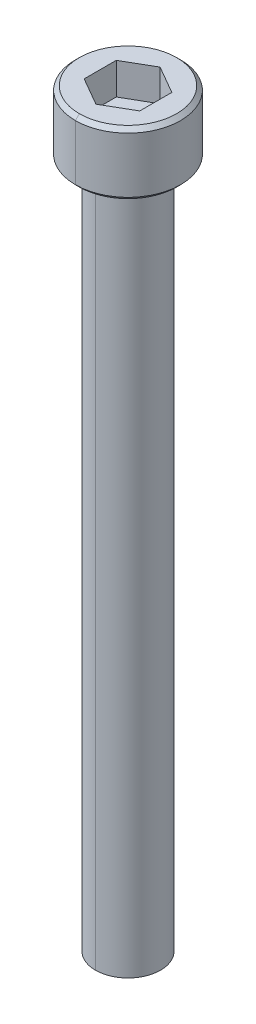
ISO-10303-21;
HEADER;
FILE_DESCRIPTION(('STEP AP214'),'2;1');
FILE_NAME('part.step','',(''),(''),'','','');
FILE_SCHEMA(('AUTOMOTIVE_DESIGN { 1 0 10303 214 1 1 1 1 }'));
ENDSEC;
DATA;
#1=APPLICATION_CONTEXT('core data for automotive mechanical design processes');
#2=APPLICATION_PROTOCOL_DEFINITION('international standard','automotive_design',2000,#1);
#3=PRODUCT_CONTEXT('',#1,'mechanical');
#4=PRODUCT('Part','Part','',(#3));
#5=PRODUCT_RELATED_PRODUCT_CATEGORY('part','',(#4));
#6=PRODUCT_DEFINITION_FORMATION('','',#4);
#7=PRODUCT_DEFINITION_CONTEXT('part definition',#1,'design');
#8=PRODUCT_DEFINITION('design','',#6,#7);
#9=PRODUCT_DEFINITION_SHAPE('','',#8);
#10=(LENGTH_UNIT() NAMED_UNIT(*) SI_UNIT(.MILLI.,.METRE.));
#11=(NAMED_UNIT(*) PLANE_ANGLE_UNIT() SI_UNIT($,.RADIAN.));
#12=(NAMED_UNIT(*) SI_UNIT($,.STERADIAN.) SOLID_ANGLE_UNIT());
#13=UNCERTAINTY_MEASURE_WITH_UNIT(LENGTH_MEASURE(1.E-05),#10,'distance_accuracy_value','');
#14=(GEOMETRIC_REPRESENTATION_CONTEXT(3) GLOBAL_UNCERTAINTY_ASSIGNED_CONTEXT((#13)) GLOBAL_UNIT_ASSIGNED_CONTEXT((#10,
#11,#12)) REPRESENTATION_CONTEXT('',''));
#15=CARTESIAN_POINT('',(0.,0.,0.));
#16=DIRECTION('',(0.,0.,1.));
#17=DIRECTION('',(1.,0.,0.));
#18=AXIS2_PLACEMENT_3D('',#15,#16,#17);
#19=CARTESIAN_POINT('',(0.,-43.91152,0.));
#20=DIRECTION('',(0.,1.,0.));
#21=DIRECTION('',(0.,0.,1.));
#22=AXIS2_PLACEMENT_3D('',#19,#20,#21);
#23=CONICAL_SURFACE('',#22,2.0828,0.960291895410485);
#24=DIRECTION('',(0.,0.573280843383966,-0.819358941251616));
#25=VECTOR('',#24,1.);
#26=CARTESIAN_POINT('',(0.,-43.91152,-2.0828));
#27=LINE('',#26,#25);
#28=CARTESIAN_POINT('',(0.,-44.45,-1.31318));
#29=VERTEX_POINT('',#28);
#30=CARTESIAN_POINT('',(0.,-43.91152,-2.0828));
#31=VERTEX_POINT('',#30);
#32=EDGE_CURVE('E205',#29,#31,#27,.T.);
#33=ORIENTED_EDGE('',*,*,#32,.F.);
#34=CARTESIAN_POINT('',(0.,-44.45,0.));
#35=DIRECTION('',(0.,-1.,0.));
#36=DIRECTION('',(0.,0.,1.));
#37=AXIS2_PLACEMENT_3D('',#34,#35,#36);
#38=CIRCLE('',#37,1.31318);
#39=CARTESIAN_POINT('',(0.,-44.45,1.31318));
#40=VERTEX_POINT('',#39);
#41=EDGE_CURVE('E151',#40,#29,#38,.T.);
#42=ORIENTED_EDGE('',*,*,#41,.F.);
#43=DIRECTION('',(0.,0.573280843383966,0.819358941251616));
#44=VECTOR('',#43,1.);
#45=CARTESIAN_POINT('',(0.,-43.91152,2.0828));
#46=LINE('',#45,#44);
#47=CARTESIAN_POINT('',(0.,-43.91152,2.0828));
#48=VERTEX_POINT('',#47);
#49=EDGE_CURVE('E232',#40,#48,#46,.T.);
#50=ORIENTED_EDGE('',*,*,#49,.T.);
#51=CARTESIAN_POINT('',(0.,-43.91152,0.));
#52=DIRECTION('',(0.,1.,0.));
#53=DIRECTION('',(0.,0.,1.));
#54=AXIS2_PLACEMENT_3D('',#51,#52,#53);
#55=CIRCLE('',#54,2.0828);
#56=EDGE_CURVE('E180',#31,#48,#55,.T.);
#57=ORIENTED_EDGE('',*,*,#56,.F.);
#58=EDGE_LOOP('',(#33,#42,#50,#57));
#59=FACE_BOUND('',#58,.T.);
#60=ADVANCED_FACE('F16',(#59),#23,.T.);
#61=CARTESIAN_POINT('',(0.,0.254,0.));
#62=DIRECTION('',(0.,1.,0.));
#63=DIRECTION('',(0.,0.,1.));
#64=AXIS2_PLACEMENT_3D('',#61,#62,#63);
#65=CONICAL_SURFACE('',#64,3.3655,0.785398163397457);
#66=DIRECTION('',(0.,0.707106781186541,-0.707106781186554));
#67=VECTOR('',#66,1.);
#68=CARTESIAN_POINT('',(0.,0.254,-3.3655));
#69=LINE('',#68,#67);
#70=CARTESIAN_POINT('',(0.,0.,-3.1115));
#71=VERTEX_POINT('',#70);
#72=CARTESIAN_POINT('',(0.,0.254,-3.3655));
#73=VERTEX_POINT('',#72);
#74=EDGE_CURVE('E236',#71,#73,#69,.T.);
#75=ORIENTED_EDGE('',*,*,#74,.F.);
#76=CARTESIAN_POINT('',(0.,0.,0.));
#77=DIRECTION('',(0.,-1.,0.));
#78=DIRECTION('',(0.,0.,1.));
#79=AXIS2_PLACEMENT_3D('',#76,#77,#78);
#80=CIRCLE('',#79,3.1115);
#81=CARTESIAN_POINT('',(0.,0.,3.1115));
#82=VERTEX_POINT('',#81);
#83=EDGE_CURVE('E188',#82,#71,#80,.T.);
#84=ORIENTED_EDGE('',*,*,#83,.F.);
#85=DIRECTION('',(0.,0.707106781186541,0.707106781186554));
#86=VECTOR('',#85,1.);
#87=CARTESIAN_POINT('',(0.,0.254,3.3655));
#88=LINE('',#87,#86);
#89=CARTESIAN_POINT('',(0.,0.254,3.3655));
#90=VERTEX_POINT('',#89);
#91=EDGE_CURVE('E176',#82,#90,#88,.T.);
#92=ORIENTED_EDGE('',*,*,#91,.T.);
#93=CARTESIAN_POINT('',(0.,0.254,0.));
#94=DIRECTION('',(0.,1.,0.));
#95=DIRECTION('',(0.,0.,1.));
#96=AXIS2_PLACEMENT_3D('',#93,#94,#95);
#97=CIRCLE('',#96,3.3655);
#98=EDGE_CURVE('E150',#73,#90,#97,.T.);
#99=ORIENTED_EDGE('',*,*,#98,.F.);
#100=EDGE_LOOP('',(#75,#84,#92,#99));
#101=FACE_BOUND('',#100,.T.);
#102=ADVANCED_FACE('F332',(#101),#65,.T.);
#103=CARTESIAN_POINT('',(0.,4.064,0.));
#104=DIRECTION('',(0.,-1.,0.));
#105=DIRECTION('',(0.,0.,-1.));
#106=AXIS2_PLACEMENT_3D('',#103,#104,#105);
#107=CONICAL_SURFACE('',#106,3.1115,0.785398163397452);
#108=DIRECTION('',(0.,-0.707106781186545,0.707106781186551));
#109=VECTOR('',#108,1.);
#110=CARTESIAN_POINT('',(0.,4.064,3.1115));
#111=LINE('',#110,#109);
#112=CARTESIAN_POINT('',(0.,4.064,3.1115));
#113=VERTEX_POINT('',#112);
#114=CARTESIAN_POINT('',(0.,3.81,3.3655));
#115=VERTEX_POINT('',#114);
#116=EDGE_CURVE('E141',#113,#115,#111,.T.);
#117=ORIENTED_EDGE('',*,*,#116,.F.);
#118=CARTESIAN_POINT('',(0.,4.064,0.));
#119=DIRECTION('',(0.,1.,0.));
#120=DIRECTION('',(0.,0.,1.));
#121=AXIS2_PLACEMENT_3D('',#118,#119,#120);
#122=CIRCLE('',#121,3.1115);
#123=CARTESIAN_POINT('',(0.,4.064,-3.1115));
#124=VERTEX_POINT('',#123);
#125=EDGE_CURVE('E272',#124,#113,#122,.T.);
#126=ORIENTED_EDGE('',*,*,#125,.F.);
#127=DIRECTION('',(0.,-0.707106781186545,-0.707106781186551));
#128=VECTOR('',#127,1.);
#129=CARTESIAN_POINT('',(0.,4.064,-3.1115));
#130=LINE('',#129,#128);
#131=CARTESIAN_POINT('',(0.,3.81,-3.3655));
#132=VERTEX_POINT('',#131);
#133=EDGE_CURVE('E144',#124,#132,#130,.T.);
#134=ORIENTED_EDGE('',*,*,#133,.T.);
#135=CARTESIAN_POINT('',(0.,3.81,0.));
#136=DIRECTION('',(0.,-1.,0.));
#137=DIRECTION('',(0.,0.,1.));
#138=AXIS2_PLACEMENT_3D('',#135,#136,#137);
#139=CIRCLE('',#138,3.3655);
#140=EDGE_CURVE('E137',#115,#132,#139,.T.);
#141=ORIENTED_EDGE('',*,*,#140,.F.);
#142=EDGE_LOOP('',(#117,#126,#134,#141));
#143=FACE_BOUND('',#142,.T.);
#144=ADVANCED_FACE('F139',(#143),#107,.T.);
#145=CARTESIAN_POINT('',(1.778,2.032,3.07958633585746));
#146=DIRECTION('',(0.,1.,0.));
#147=DIRECTION('',(1.,0.,0.));
#148=AXIS2_PLACEMENT_3D('',#145,#146,#147);
#149=PLANE('',#148);
#150=DIRECTION('',(0.86602540378444,0.,0.5));
#151=VECTOR('',#150,1.);
#152=CARTESIAN_POINT('',(-1.778,2.032,1.02652877861917));
#153=LINE('',#152,#151);
#154=CARTESIAN_POINT('',(-1.778,2.032,1.02652877861917));
#155=VERTEX_POINT('',#154);
#156=CARTESIAN_POINT('',(0.,2.032,2.05305755723831));
#157=VERTEX_POINT('',#156);
#158=EDGE_CURVE('E221',#155,#157,#153,.T.);
#159=ORIENTED_EDGE('',*,*,#158,.T.);
#160=DIRECTION('',(0.866025403784439,0.,-0.5));
#161=VECTOR('',#160,1.);
#162=CARTESIAN_POINT('',(0.,2.032,2.05305755723831));
#163=LINE('',#162,#161);
#164=CARTESIAN_POINT('',(1.778,2.032,1.02652877861915));
#165=VERTEX_POINT('',#164);
#166=EDGE_CURVE('E11',#157,#165,#163,.T.);
#167=ORIENTED_EDGE('',*,*,#166,.T.);
#168=DIRECTION('',(0.,0.,-1.));
#169=VECTOR('',#168,1.);
#170=CARTESIAN_POINT('',(1.778,2.032,1.02652877861915));
#171=LINE('',#170,#169);
#172=CARTESIAN_POINT('',(1.778,2.032,-1.02652877861913));
#173=VERTEX_POINT('',#172);
#174=EDGE_CURVE('E195',#165,#173,#171,.T.);
#175=ORIENTED_EDGE('',*,*,#174,.T.);
#176=DIRECTION('',(-0.866025403784439,0.,-0.5));
#177=VECTOR('',#176,1.);
#178=CARTESIAN_POINT('',(1.778,2.032,-1.02652877861913));
#179=LINE('',#178,#177);
#180=CARTESIAN_POINT('',(0.,2.032,-2.05305755723831));
#181=VERTEX_POINT('',#180);
#182=EDGE_CURVE('E218',#173,#181,#179,.T.);
#183=ORIENTED_EDGE('',*,*,#182,.T.);
#184=DIRECTION('',(-0.866025403784439,0.,0.5));
#185=VECTOR('',#184,1.);
#186=CARTESIAN_POINT('',(0.,2.032,-2.05305755723831));
#187=LINE('',#186,#185);
#188=CARTESIAN_POINT('',(-1.778,2.032,-1.02652877861913));
#189=VERTEX_POINT('',#188);
#190=EDGE_CURVE('E20',#181,#189,#187,.T.);
#191=ORIENTED_EDGE('',*,*,#190,.T.);
#192=DIRECTION('',(0.,0.,1.));
#193=VECTOR('',#192,1.);
#194=CARTESIAN_POINT('',(-1.778,2.032,-1.02652877861913));
#195=LINE('',#194,#193);
#196=EDGE_CURVE('E225',#189,#155,#195,.T.);
#197=ORIENTED_EDGE('',*,*,#196,.T.);
#198=EDGE_LOOP('',(#159,#167,#175,#183,#191,#197));
#199=FACE_BOUND('',#198,.T.);
#200=ADVANCED_FACE('F18',(#199),#149,.T.);
#201=CARTESIAN_POINT('',(0.,2.032,2.05305755723831));
#202=DIRECTION('',(0.5,0.,0.866025403784439));
#203=DIRECTION('',(0.,-1.,0.));
#204=AXIS2_PLACEMENT_3D('',#201,#202,#203);
#205=PLANE('',#204);
#206=DIRECTION('',(0.866025403784439,0.,-0.5));
#207=VECTOR('',#206,1.);
#208=CARTESIAN_POINT('',(0.,4.064,2.05305755723831));
#209=LINE('',#208,#207);
#210=CARTESIAN_POINT('',(0.,4.064,2.05305755723831));
#211=VERTEX_POINT('',#210);
#212=CARTESIAN_POINT('',(1.778,4.064,1.02652877861915));
#213=VERTEX_POINT('',#212);
#214=EDGE_CURVE('E185',#211,#213,#209,.T.);
#215=ORIENTED_EDGE('',*,*,#214,.T.);
#216=DIRECTION('',(0.,1.,0.));
#217=VECTOR('',#216,1.);
#218=CARTESIAN_POINT('',(1.778,2.032,1.02652877861915));
#219=LINE('',#218,#217);
#220=EDGE_CURVE('E27',#165,#213,#219,.T.);
#221=ORIENTED_EDGE('',*,*,#220,.F.);
#222=ORIENTED_EDGE('',*,*,#166,.F.);
#223=DIRECTION('',(0.,1.,0.));
#224=VECTOR('',#223,1.);
#225=CARTESIAN_POINT('',(0.,2.032,2.05305755723831));
#226=LINE('',#225,#224);
#227=EDGE_CURVE('E192',#157,#211,#226,.T.);
#228=ORIENTED_EDGE('',*,*,#227,.T.);
#229=EDGE_LOOP('',(#215,#221,#222,#228));
#230=FACE_BOUND('',#229,.T.);
#231=ADVANCED_FACE('F280',(#230),#205,.F.);
#232=CARTESIAN_POINT('',(1.778,2.032,1.02652877861915));
#233=DIRECTION('',(1.,0.,0.));
#234=DIRECTION('',(0.,0.,1.));
#235=AXIS2_PLACEMENT_3D('',#232,#233,#234);
#236=PLANE('',#235);
#237=DIRECTION('',(0.,0.,-1.));
#238=VECTOR('',#237,1.);
#239=CARTESIAN_POINT('',(1.778,4.064,1.02652877861915));
#240=LINE('',#239,#238);
#241=CARTESIAN_POINT('',(1.778,4.064,-1.02652877861913));
#242=VERTEX_POINT('',#241);
#243=EDGE_CURVE('E182',#213,#242,#240,.T.);
#244=ORIENTED_EDGE('',*,*,#243,.T.);
#245=DIRECTION('',(0.,1.,0.));
#246=VECTOR('',#245,1.);
#247=CARTESIAN_POINT('',(1.778,2.032,-1.02652877861913));
#248=LINE('',#247,#246);
#249=EDGE_CURVE('E215',#173,#242,#248,.T.);
#250=ORIENTED_EDGE('',*,*,#249,.F.);
#251=ORIENTED_EDGE('',*,*,#174,.F.);
#252=ORIENTED_EDGE('',*,*,#220,.T.);
#253=EDGE_LOOP('',(#244,#250,#251,#252));
#254=FACE_BOUND('',#253,.T.);
#255=ADVANCED_FACE('F372',(#254),#236,.F.);
#256=CARTESIAN_POINT('',(1.778,2.032,-1.02652877861913));
#257=DIRECTION('',(0.5,0.,-0.866025403784439));
#258=DIRECTION('',(0.,-1.,0.));
#259=AXIS2_PLACEMENT_3D('',#256,#257,#258);
#260=PLANE('',#259);
#261=DIRECTION('',(-0.866025403784439,0.,-0.5));
#262=VECTOR('',#261,1.);
#263=CARTESIAN_POINT('',(1.778,4.064,-1.02652877861913));
#264=LINE('',#263,#262);
#265=CARTESIAN_POINT('',(0.,4.064,-2.05305755723831));
#266=VERTEX_POINT('',#265);
#267=EDGE_CURVE('E186',#242,#266,#264,.T.);
#268=ORIENTED_EDGE('',*,*,#267,.T.);
#269=DIRECTION('',(0.,1.,0.));
#270=VECTOR('',#269,1.);
#271=CARTESIAN_POINT('',(0.,2.032,-2.05305755723831));
#272=LINE('',#271,#270);
#273=EDGE_CURVE('E239',#181,#266,#272,.T.);
#274=ORIENTED_EDGE('',*,*,#273,.F.);
#275=ORIENTED_EDGE('',*,*,#182,.F.);
#276=ORIENTED_EDGE('',*,*,#249,.T.);
#277=EDGE_LOOP('',(#268,#274,#275,#276));
#278=FACE_BOUND('',#277,.T.);
#279=ADVANCED_FACE('F367',(#278),#260,.F.);
#280=CARTESIAN_POINT('',(0.,2.032,-2.05305755723831));
#281=DIRECTION('',(-0.5,0.,-0.866025403784439));
#282=DIRECTION('',(-0.866025403784439,0.,0.5));
#283=AXIS2_PLACEMENT_3D('',#280,#281,#282);
#284=PLANE('',#283);
#285=DIRECTION('',(-0.866025403784439,0.,0.5));
#286=VECTOR('',#285,1.);
#287=CARTESIAN_POINT('',(0.,4.064,-2.05305755723831));
#288=LINE('',#287,#286);
#289=CARTESIAN_POINT('',(-1.778,4.064,-1.02652877861913));
#290=VERTEX_POINT('',#289);
#291=EDGE_CURVE('E214',#266,#290,#288,.T.);
#292=ORIENTED_EDGE('',*,*,#291,.T.);
#293=DIRECTION('',(0.,1.,0.));
#294=VECTOR('',#293,1.);
#295=CARTESIAN_POINT('',(-1.778,2.032,-1.02652877861913));
#296=LINE('',#295,#294);
#297=EDGE_CURVE('E228',#189,#290,#296,.T.);
#298=ORIENTED_EDGE('',*,*,#297,.F.);
#299=ORIENTED_EDGE('',*,*,#190,.F.);
#300=ORIENTED_EDGE('',*,*,#273,.T.);
#301=EDGE_LOOP('',(#292,#298,#299,#300));
#302=FACE_BOUND('',#301,.T.);
#303=ADVANCED_FACE('F365',(#302),#284,.F.);
#304=CARTESIAN_POINT('',(-1.778,2.032,-1.02652877861913));
#305=DIRECTION('',(-1.,0.,0.));
#306=DIRECTION('',(0.,0.,1.));
#307=AXIS2_PLACEMENT_3D('',#304,#305,#306);
#308=PLANE('',#307);
#309=DIRECTION('',(0.,0.,1.));
#310=VECTOR('',#309,1.);
#311=CARTESIAN_POINT('',(-1.778,4.064,-1.02652877861913));
#312=LINE('',#311,#310);
#313=CARTESIAN_POINT('',(-1.778,4.064,1.02652877861917));
#314=VERTEX_POINT('',#313);
#315=EDGE_CURVE('E260',#290,#314,#312,.T.);
#316=ORIENTED_EDGE('',*,*,#315,.T.);
#317=DIRECTION('',(0.,1.,0.));
#318=VECTOR('',#317,1.);
#319=CARTESIAN_POINT('',(-1.778,2.032,1.02652877861917));
#320=LINE('',#319,#318);
#321=EDGE_CURVE('E223',#155,#314,#320,.T.);
#322=ORIENTED_EDGE('',*,*,#321,.F.);
#323=ORIENTED_EDGE('',*,*,#196,.F.);
#324=ORIENTED_EDGE('',*,*,#297,.T.);
#325=EDGE_LOOP('',(#316,#322,#323,#324));
#326=FACE_BOUND('',#325,.T.);
#327=ADVANCED_FACE('F297',(#326),#308,.F.);
#328=CARTESIAN_POINT('',(-1.778,2.032,1.02652877861917));
#329=DIRECTION('',(-0.5,0.,0.866025403784439));
#330=DIRECTION('',(0.,1.,0.));
#331=AXIS2_PLACEMENT_3D('',#328,#329,#330);
#332=PLANE('',#331);
#333=DIRECTION('',(0.86602540378444,0.,0.5));
#334=VECTOR('',#333,1.);
#335=CARTESIAN_POINT('',(-1.778,4.064,1.02652877861917));
#336=LINE('',#335,#334);
#337=EDGE_CURVE('E268',#314,#211,#336,.T.);
#338=ORIENTED_EDGE('',*,*,#337,.T.);
#339=ORIENTED_EDGE('',*,*,#227,.F.);
#340=ORIENTED_EDGE('',*,*,#158,.F.);
#341=ORIENTED_EDGE('',*,*,#321,.T.);
#342=EDGE_LOOP('',(#338,#339,#340,#341));
#343=FACE_BOUND('',#342,.T.);
#344=ADVANCED_FACE('F292',(#343),#332,.F.);
#345=CARTESIAN_POINT('',(0.,0.,0.));
#346=DIRECTION('',(0.,1.,0.));
#347=DIRECTION('',(1.,0.,0.));
#348=AXIS2_PLACEMENT_3D('',#345,#346,#347);
#349=PLANE('',#348);
#350=CARTESIAN_POINT('',(0.,0.,0.));
#351=DIRECTION('',(0.,1.,0.));
#352=DIRECTION('',(0.,0.,1.));
#353=AXIS2_PLACEMENT_3D('',#350,#351,#352);
#354=CIRCLE('',#353,2.0828);
#355=CARTESIAN_POINT('',(0.,0.,2.0828));
#356=VERTEX_POINT('',#355);
#357=CARTESIAN_POINT('',(0.,0.,-2.0828));
#358=VERTEX_POINT('',#357);
#359=EDGE_CURVE('E200',#356,#358,#354,.T.);
#360=ORIENTED_EDGE('',*,*,#359,.T.);
#361=CARTESIAN_POINT('',(0.,0.,0.));
#362=DIRECTION('',(0.,1.,0.));
#363=DIRECTION('',(0.,0.,1.));
#364=AXIS2_PLACEMENT_3D('',#361,#362,#363);
#365=CIRCLE('',#364,2.0828);
#366=EDGE_CURVE('E201',#358,#356,#365,.T.);
#367=ORIENTED_EDGE('',*,*,#366,.T.);
#368=EDGE_LOOP('',(#360,#367));
#369=FACE_BOUND('',#368,.T.);
#370=ORIENTED_EDGE('',*,*,#83,.T.);
#371=CARTESIAN_POINT('',(0.,0.,0.));
#372=DIRECTION('',(0.,-1.,0.));
#373=DIRECTION('',(0.,0.,1.));
#374=AXIS2_PLACEMENT_3D('',#371,#372,#373);
#375=CIRCLE('',#374,3.1115);
#376=EDGE_CURVE('E253',#71,#82,#375,.T.);
#377=ORIENTED_EDGE('',*,*,#376,.T.);
#378=EDGE_LOOP('',(#370,#377));
#379=FACE_BOUND('',#378,.T.);
#380=ADVANCED_FACE('F318',(#369,#379),#349,.F.);
#381=CARTESIAN_POINT('',(0.,4.064,0.));
#382=DIRECTION('',(0.,1.,0.));
#383=DIRECTION('',(1.,0.,0.));
#384=AXIS2_PLACEMENT_3D('',#381,#382,#383);
#385=PLANE('',#384);
#386=ORIENTED_EDGE('',*,*,#337,.F.);
#387=ORIENTED_EDGE('',*,*,#315,.F.);
#388=ORIENTED_EDGE('',*,*,#291,.F.);
#389=ORIENTED_EDGE('',*,*,#267,.F.);
#390=ORIENTED_EDGE('',*,*,#243,.F.);
#391=ORIENTED_EDGE('',*,*,#214,.F.);
#392=EDGE_LOOP('',(#386,#387,#388,#389,#390,#391));
#393=FACE_BOUND('',#392,.T.);
#394=ORIENTED_EDGE('',*,*,#125,.T.);
#395=CARTESIAN_POINT('',(0.,4.064,0.));
#396=DIRECTION('',(0.,1.,0.));
#397=DIRECTION('',(0.,0.,1.));
#398=AXIS2_PLACEMENT_3D('',#395,#396,#397);
#399=CIRCLE('',#398,3.1115);
#400=EDGE_CURVE('E169',#113,#124,#399,.T.);
#401=ORIENTED_EDGE('',*,*,#400,.T.);
#402=EDGE_LOOP('',(#394,#401));
#403=FACE_BOUND('',#402,.T.);
#404=ADVANCED_FACE('F286',(#393,#403),#385,.T.);
#405=CARTESIAN_POINT('',(0.,4.064,0.));
#406=DIRECTION('',(0.,-1.,0.));
#407=DIRECTION('',(0.,0.,-1.));
#408=AXIS2_PLACEMENT_3D('',#405,#406,#407);
#409=CYLINDRICAL_SURFACE('',#408,3.3655);
#410=DIRECTION('',(0.,-1.,0.));
#411=VECTOR('',#410,1.);
#412=CARTESIAN_POINT('',(0.,4.064,3.3655));
#413=LINE('',#412,#411);
#414=EDGE_CURVE('E154',#115,#90,#413,.T.);
#415=ORIENTED_EDGE('',*,*,#414,.F.);
#416=ORIENTED_EDGE('',*,*,#140,.T.);
#417=DIRECTION('',(0.,-1.,0.));
#418=VECTOR('',#417,1.);
#419=CARTESIAN_POINT('',(0.,4.064,-3.3655));
#420=LINE('',#419,#418);
#421=EDGE_CURVE('E161',#132,#73,#420,.T.);
#422=ORIENTED_EDGE('',*,*,#421,.T.);
#423=ORIENTED_EDGE('',*,*,#98,.T.);
#424=EDGE_LOOP('',(#415,#416,#422,#423));
#425=FACE_BOUND('',#424,.T.);
#426=ADVANCED_FACE('F156',(#425),#409,.T.);
#427=CARTESIAN_POINT('',(0.,-44.45,0.));
#428=DIRECTION('',(0.,1.,0.));
#429=DIRECTION('',(1.,0.,0.));
#430=AXIS2_PLACEMENT_3D('',#427,#428,#429);
#431=PLANE('',#430);
#432=ORIENTED_EDGE('',*,*,#41,.T.);
#433=CARTESIAN_POINT('',(0.,-44.45,0.));
#434=DIRECTION('',(0.,-1.,0.));
#435=DIRECTION('',(0.,0.,1.));
#436=AXIS2_PLACEMENT_3D('',#433,#434,#435);
#437=CIRCLE('',#436,1.31318);
#438=EDGE_CURVE('E210',#29,#40,#437,.T.);
#439=ORIENTED_EDGE('',*,*,#438,.T.);
#440=EDGE_LOOP('',(#432,#439));
#441=FACE_BOUND('',#440,.T.);
#442=ADVANCED_FACE('F325',(#441),#431,.F.);
#443=CARTESIAN_POINT('',(0.,-44.45,0.));
#444=DIRECTION('',(0.,1.,0.));
#445=DIRECTION('',(0.,0.,1.));
#446=AXIS2_PLACEMENT_3D('',#443,#444,#445);
#447=CYLINDRICAL_SURFACE('',#446,2.0828);
#448=DIRECTION('',(0.,1.,0.));
#449=VECTOR('',#448,1.);
#450=CARTESIAN_POINT('',(0.,-44.45,-2.0828));
#451=LINE('',#450,#449);
#452=EDGE_CURVE('E248',#31,#358,#451,.T.);
#453=ORIENTED_EDGE('',*,*,#452,.F.);
#454=ORIENTED_EDGE('',*,*,#56,.T.);
#455=DIRECTION('',(0.,1.,0.));
#456=VECTOR('',#455,1.);
#457=CARTESIAN_POINT('',(0.,-44.45,2.0828));
#458=LINE('',#457,#456);
#459=EDGE_CURVE('E196',#48,#356,#458,.T.);
#460=ORIENTED_EDGE('',*,*,#459,.T.);
#461=ORIENTED_EDGE('',*,*,#366,.F.);
#462=EDGE_LOOP('',(#453,#454,#460,#461));
#463=FACE_BOUND('',#462,.T.);
#464=ADVANCED_FACE('F349',(#463),#447,.T.);
#465=CARTESIAN_POINT('',(0.,-44.45,0.));
#466=DIRECTION('',(0.,1.,0.));
#467=DIRECTION('',(0.,0.,1.));
#468=AXIS2_PLACEMENT_3D('',#465,#466,#467);
#469=CYLINDRICAL_SURFACE('',#468,2.0828);
#470=CARTESIAN_POINT('',(0.,-43.91152,0.));
#471=DIRECTION('',(0.,1.,0.));
#472=DIRECTION('',(0.,0.,1.));
#473=AXIS2_PLACEMENT_3D('',#470,#471,#472);
#474=CIRCLE('',#473,2.0828);
#475=EDGE_CURVE('E209',#48,#31,#474,.T.);
#476=ORIENTED_EDGE('',*,*,#475,.T.);
#477=ORIENTED_EDGE('',*,*,#452,.T.);
#478=ORIENTED_EDGE('',*,*,#359,.F.);
#479=ORIENTED_EDGE('',*,*,#459,.F.);
#480=EDGE_LOOP('',(#476,#477,#478,#479));
#481=FACE_BOUND('',#480,.T.);
#482=ADVANCED_FACE('F342',(#481),#469,.T.);
#483=CARTESIAN_POINT('',(0.,4.064,0.));
#484=DIRECTION('',(0.,-1.,0.));
#485=DIRECTION('',(0.,0.,-1.));
#486=AXIS2_PLACEMENT_3D('',#483,#484,#485);
#487=CYLINDRICAL_SURFACE('',#486,3.3655);
#488=CARTESIAN_POINT('',(0.,3.81,0.));
#489=DIRECTION('',(0.,-1.,0.));
#490=DIRECTION('',(0.,0.,1.));
#491=AXIS2_PLACEMENT_3D('',#488,#489,#490);
#492=CIRCLE('',#491,3.3655);
#493=EDGE_CURVE('E162',#132,#115,#492,.T.);
#494=ORIENTED_EDGE('',*,*,#493,.T.);
#495=ORIENTED_EDGE('',*,*,#414,.T.);
#496=CARTESIAN_POINT('',(0.,0.254,0.));
#497=DIRECTION('',(0.,1.,0.));
#498=DIRECTION('',(0.,0.,1.));
#499=AXIS2_PLACEMENT_3D('',#496,#497,#498);
#500=CIRCLE('',#499,3.3655);
#501=EDGE_CURVE('E233',#90,#73,#500,.T.);
#502=ORIENTED_EDGE('',*,*,#501,.T.);
#503=ORIENTED_EDGE('',*,*,#421,.F.);
#504=EDGE_LOOP('',(#494,#495,#502,#503));
#505=FACE_BOUND('',#504,.T.);
#506=ADVANCED_FACE('F163',(#505),#487,.T.);
#507=CARTESIAN_POINT('',(0.,4.064,0.));
#508=DIRECTION('',(0.,-1.,0.));
#509=DIRECTION('',(0.,0.,-1.));
#510=AXIS2_PLACEMENT_3D('',#507,#508,#509);
#511=CONICAL_SURFACE('',#510,3.1115,0.785398163397452);
#512=ORIENTED_EDGE('',*,*,#400,.F.);
#513=ORIENTED_EDGE('',*,*,#116,.T.);
#514=ORIENTED_EDGE('',*,*,#493,.F.);
#515=ORIENTED_EDGE('',*,*,#133,.F.);
#516=EDGE_LOOP('',(#512,#513,#514,#515));
#517=FACE_BOUND('',#516,.T.);
#518=ADVANCED_FACE('F167',(#517),#511,.T.);
#519=CARTESIAN_POINT('',(0.,0.254,0.));
#520=DIRECTION('',(0.,1.,0.));
#521=DIRECTION('',(0.,0.,1.));
#522=AXIS2_PLACEMENT_3D('',#519,#520,#521);
#523=CONICAL_SURFACE('',#522,3.3655,0.785398163397457);
#524=ORIENTED_EDGE('',*,*,#376,.F.);
#525=ORIENTED_EDGE('',*,*,#74,.T.);
#526=ORIENTED_EDGE('',*,*,#501,.F.);
#527=ORIENTED_EDGE('',*,*,#91,.F.);
#528=EDGE_LOOP('',(#524,#525,#526,#527));
#529=FACE_BOUND('',#528,.T.);
#530=ADVANCED_FACE('F347',(#529),#523,.T.);
#531=CARTESIAN_POINT('',(0.,-43.91152,0.));
#532=DIRECTION('',(0.,1.,0.));
#533=DIRECTION('',(0.,0.,1.));
#534=AXIS2_PLACEMENT_3D('',#531,#532,#533);
#535=CONICAL_SURFACE('',#534,2.0828,0.960291895410485);
#536=ORIENTED_EDGE('',*,*,#438,.F.);
#537=ORIENTED_EDGE('',*,*,#32,.T.);
#538=ORIENTED_EDGE('',*,*,#475,.F.);
#539=ORIENTED_EDGE('',*,*,#49,.F.);
#540=EDGE_LOOP('',(#536,#537,#538,#539));
#541=FACE_BOUND('',#540,.T.);
#542=ADVANCED_FACE('F569',(#541),#535,.T.);
#543=CLOSED_SHELL('',(#60,#102,#144,#200,#231,#255,#279,#303,#327,#344,#380,#404,#426,#442,#464,
#482,#506,#518,#530,#542));
#544=MANIFOLD_SOLID_BREP('B1',#543);
#545=ADVANCED_BREP_SHAPE_REPRESENTATION('',(#18,#544),#14);
#546=SHAPE_DEFINITION_REPRESENTATION(#9,#545);
ENDSEC;
END-ISO-10303-21;
